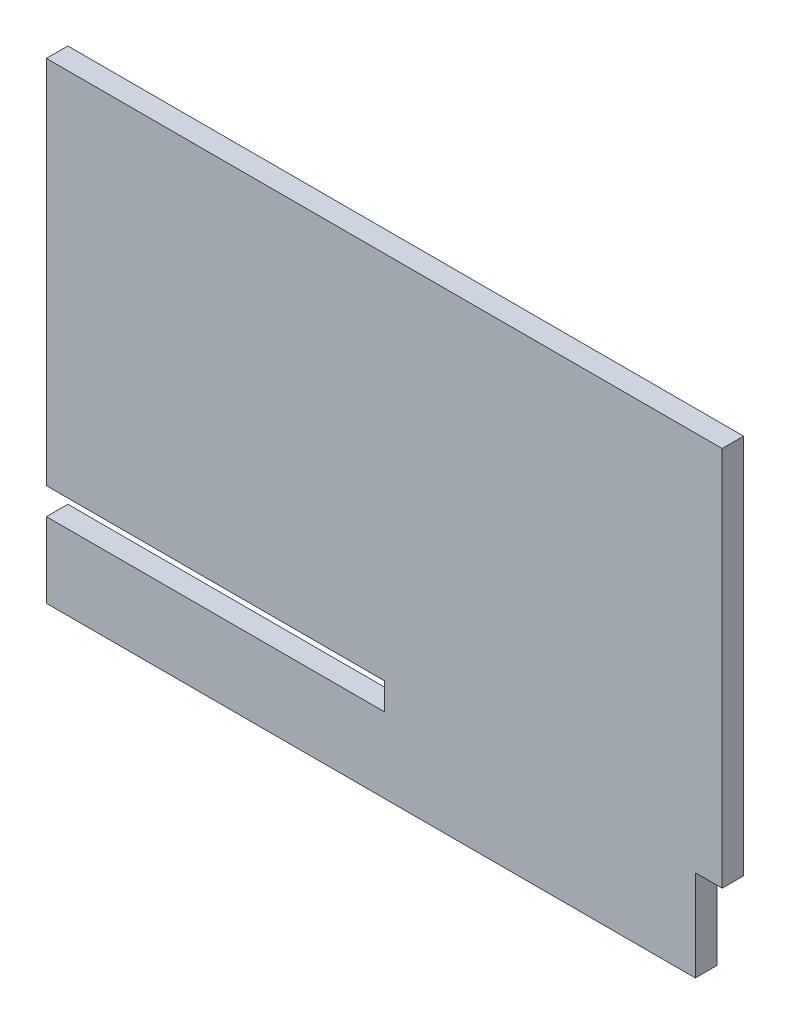
ISO-10303-21;
HEADER;
FILE_DESCRIPTION(('STEP AP214'),'2;1');
FILE_NAME('part.step','',(''),(''),'','','');
FILE_SCHEMA(('AUTOMOTIVE_DESIGN { 1 0 10303 214 1 1 1 1 }'));
ENDSEC;
DATA;
#1=APPLICATION_CONTEXT('core data for automotive mechanical design processes');
#2=APPLICATION_PROTOCOL_DEFINITION('international standard','automotive_design',2000,#1);
#3=PRODUCT_CONTEXT('',#1,'mechanical');
#4=PRODUCT('Part','Part','',(#3));
#5=PRODUCT_RELATED_PRODUCT_CATEGORY('part','',(#4));
#6=PRODUCT_DEFINITION_FORMATION('','',#4);
#7=PRODUCT_DEFINITION_CONTEXT('part definition',#1,'design');
#8=PRODUCT_DEFINITION('design','',#6,#7);
#9=PRODUCT_DEFINITION_SHAPE('','',#8);
#10=(LENGTH_UNIT() NAMED_UNIT(*) SI_UNIT(.MILLI.,.METRE.));
#11=(NAMED_UNIT(*) PLANE_ANGLE_UNIT() SI_UNIT($,.RADIAN.));
#12=(NAMED_UNIT(*) SI_UNIT($,.STERADIAN.) SOLID_ANGLE_UNIT());
#13=UNCERTAINTY_MEASURE_WITH_UNIT(LENGTH_MEASURE(1.E-05),#10,'distance_accuracy_value','');
#14=(GEOMETRIC_REPRESENTATION_CONTEXT(3) GLOBAL_UNCERTAINTY_ASSIGNED_CONTEXT((#13)) GLOBAL_UNIT_ASSIGNED_CONTEXT((#10,
#11,#12)) REPRESENTATION_CONTEXT('',''));
#15=CARTESIAN_POINT('',(0.,0.,0.));
#16=DIRECTION('',(0.,0.,1.));
#17=DIRECTION('',(1.,0.,0.));
#18=AXIS2_PLACEMENT_3D('',#15,#16,#17);
#19=CARTESIAN_POINT('',(-315.,220.,20.));
#20=DIRECTION('',(1.,0.,0.));
#21=DIRECTION('',(0.,0.,-1.));
#22=AXIS2_PLACEMENT_3D('',#19,#20,#21);
#23=PLANE('',#22);
#24=DIRECTION('',(0.,-1.,0.));
#25=VECTOR('',#24,1.);
#26=CARTESIAN_POINT('',(-315.,220.,20.));
#27=LINE('',#26,#25);
#28=CARTESIAN_POINT('',(-315.,-150.,20.));
#29=VERTEX_POINT('',#28);
#30=CARTESIAN_POINT('',(-315.,-220.,20.));
#31=VERTEX_POINT('',#30);
#32=EDGE_CURVE('E97',#29,#31,#27,.T.);
#33=ORIENTED_EDGE('',*,*,#32,.F.);
#34=DIRECTION('',(0.,0.,-1.));
#35=VECTOR('',#34,1.);
#36=CARTESIAN_POINT('',(-315.,-150.,20.));
#37=LINE('',#36,#35);
#38=CARTESIAN_POINT('',(-315.,-150.,0.));
#39=VERTEX_POINT('',#38);
#40=EDGE_CURVE('E187',#29,#39,#37,.T.);
#41=ORIENTED_EDGE('',*,*,#40,.T.);
#42=DIRECTION('',(0.,-1.,0.));
#43=VECTOR('',#42,1.);
#44=CARTESIAN_POINT('',(-315.,220.,0.));
#45=LINE('',#44,#43);
#46=CARTESIAN_POINT('',(-315.,-220.,0.));
#47=VERTEX_POINT('',#46);
#48=EDGE_CURVE('E139',#39,#47,#45,.T.);
#49=ORIENTED_EDGE('',*,*,#48,.T.);
#50=DIRECTION('',(0.,0.,-1.));
#51=VECTOR('',#50,1.);
#52=CARTESIAN_POINT('',(-315.,-220.,20.));
#53=LINE('',#52,#51);
#54=EDGE_CURVE('E153',#31,#47,#53,.T.);
#55=ORIENTED_EDGE('',*,*,#54,.F.);
#56=EDGE_LOOP('',(#33,#41,#49,#55));
#57=FACE_BOUND('',#56,.T.);
#58=ADVANCED_FACE('F38',(#57),#23,.F.);
#59=CARTESIAN_POINT('',(-315.,220.,0.));
#60=VERTEX_POINT('',#59);
#61=CARTESIAN_POINT('',(-315.,-125.,0.));
#62=VERTEX_POINT('',#61);
#63=EDGE_CURVE('E135',#60,#62,#45,.T.);
#64=ORIENTED_EDGE('',*,*,#63,.T.);
#65=DIRECTION('',(0.,0.,1.));
#66=VECTOR('',#65,1.);
#67=CARTESIAN_POINT('',(-315.,-125.,20.));
#68=LINE('',#67,#66);
#69=CARTESIAN_POINT('',(-315.,-125.,20.));
#70=VERTEX_POINT('',#69);
#71=EDGE_CURVE('E53',#62,#70,#68,.T.);
#72=ORIENTED_EDGE('',*,*,#71,.T.);
#73=CARTESIAN_POINT('',(-315.,220.,20.));
#74=VERTEX_POINT('',#73);
#75=EDGE_CURVE('E194',#74,#70,#27,.T.);
#76=ORIENTED_EDGE('',*,*,#75,.F.);
#77=DIRECTION('',(0.,0.,-1.));
#78=VECTOR('',#77,1.);
#79=CARTESIAN_POINT('',(-315.,220.,20.));
#80=LINE('',#79,#78);
#81=EDGE_CURVE('E131',#74,#60,#80,.T.);
#82=ORIENTED_EDGE('',*,*,#81,.T.);
#83=EDGE_LOOP('',(#64,#72,#76,#82));
#84=FACE_BOUND('',#83,.T.);
#85=ADVANCED_FACE('F40',(#84),#23,.F.);
#86=CARTESIAN_POINT('',(-315.,-220.,20.));
#87=DIRECTION('',(0.,1.,0.));
#88=DIRECTION('',(0.,0.,1.));
#89=AXIS2_PLACEMENT_3D('',#86,#87,#88);
#90=PLANE('',#89);
#91=DIRECTION('',(1.,0.,0.));
#92=VECTOR('',#91,1.);
#93=CARTESIAN_POINT('',(-315.,-220.,0.));
#94=LINE('',#93,#92);
#95=CARTESIAN_POINT('',(290.,-220.,0.));
#96=VERTEX_POINT('',#95);
#97=EDGE_CURVE('E138',#47,#96,#94,.T.);
#98=ORIENTED_EDGE('',*,*,#97,.T.);
#99=DIRECTION('',(0.,0.,-1.));
#100=VECTOR('',#99,1.);
#101=CARTESIAN_POINT('',(290.,-220.,20.));
#102=LINE('',#101,#100);
#103=CARTESIAN_POINT('',(290.,-220.,20.));
#104=VERTEX_POINT('',#103);
#105=EDGE_CURVE('E150',#104,#96,#102,.T.);
#106=ORIENTED_EDGE('',*,*,#105,.F.);
#107=DIRECTION('',(1.,0.,0.));
#108=VECTOR('',#107,1.);
#109=CARTESIAN_POINT('',(-315.,-220.,20.));
#110=LINE('',#109,#108);
#111=EDGE_CURVE('E196',#31,#104,#110,.T.);
#112=ORIENTED_EDGE('',*,*,#111,.F.);
#113=ORIENTED_EDGE('',*,*,#54,.T.);
#114=EDGE_LOOP('',(#98,#106,#112,#113));
#115=FACE_BOUND('',#114,.T.);
#116=ADVANCED_FACE('F200',(#115),#90,.F.);
#117=CARTESIAN_POINT('',(290.,-135.,20.));
#118=DIRECTION('',(-1.,0.,0.));
#119=DIRECTION('',(0.,-1.,0.));
#120=AXIS2_PLACEMENT_3D('',#117,#118,#119);
#121=PLANE('',#120);
#122=DIRECTION('',(0.,1.,0.));
#123=VECTOR('',#122,1.);
#124=CARTESIAN_POINT('',(290.,-135.,0.));
#125=LINE('',#124,#123);
#126=CARTESIAN_POINT('',(290.,-135.,0.));
#127=VERTEX_POINT('',#126);
#128=EDGE_CURVE('E141',#96,#127,#125,.T.);
#129=ORIENTED_EDGE('',*,*,#128,.T.);
#130=DIRECTION('',(0.,0.,-1.));
#131=VECTOR('',#130,1.);
#132=CARTESIAN_POINT('',(290.,-135.,20.));
#133=LINE('',#132,#131);
#134=CARTESIAN_POINT('',(290.,-135.,20.));
#135=VERTEX_POINT('',#134);
#136=EDGE_CURVE('E126',#135,#127,#133,.T.);
#137=ORIENTED_EDGE('',*,*,#136,.F.);
#138=DIRECTION('',(0.,1.,0.));
#139=VECTOR('',#138,1.);
#140=CARTESIAN_POINT('',(290.,-135.,20.));
#141=LINE('',#140,#139);
#142=EDGE_CURVE('E114',#104,#135,#141,.T.);
#143=ORIENTED_EDGE('',*,*,#142,.F.);
#144=ORIENTED_EDGE('',*,*,#105,.T.);
#145=EDGE_LOOP('',(#129,#137,#143,#144));
#146=FACE_BOUND('',#145,.T.);
#147=ADVANCED_FACE('F204',(#146),#121,.F.);
#148=CARTESIAN_POINT('',(315.,-135.,20.));
#149=DIRECTION('',(0.,1.,0.));
#150=DIRECTION('',(-1.,0.,0.));
#151=AXIS2_PLACEMENT_3D('',#148,#149,#150);
#152=PLANE('',#151);
#153=DIRECTION('',(1.,0.,0.));
#154=VECTOR('',#153,1.);
#155=CARTESIAN_POINT('',(315.,-135.,0.));
#156=LINE('',#155,#154);
#157=CARTESIAN_POINT('',(315.,-135.,0.));
#158=VERTEX_POINT('',#157);
#159=EDGE_CURVE('E123',#127,#158,#156,.T.);
#160=ORIENTED_EDGE('',*,*,#159,.T.);
#161=DIRECTION('',(0.,0.,-1.));
#162=VECTOR('',#161,1.);
#163=CARTESIAN_POINT('',(315.,-135.,20.));
#164=LINE('',#163,#162);
#165=CARTESIAN_POINT('',(315.,-135.,20.));
#166=VERTEX_POINT('',#165);
#167=EDGE_CURVE('E120',#166,#158,#164,.T.);
#168=ORIENTED_EDGE('',*,*,#167,.F.);
#169=DIRECTION('',(1.,0.,0.));
#170=VECTOR('',#169,1.);
#171=CARTESIAN_POINT('',(315.,-135.,20.));
#172=LINE('',#171,#170);
#173=EDGE_CURVE('E107',#135,#166,#172,.T.);
#174=ORIENTED_EDGE('',*,*,#173,.F.);
#175=ORIENTED_EDGE('',*,*,#136,.T.);
#176=EDGE_LOOP('',(#160,#168,#174,#175));
#177=FACE_BOUND('',#176,.T.);
#178=ADVANCED_FACE('F121',(#177),#152,.F.);
#179=CARTESIAN_POINT('',(315.,220.,20.));
#180=DIRECTION('',(-1.,0.,0.));
#181=DIRECTION('',(0.,-1.,0.));
#182=AXIS2_PLACEMENT_3D('',#179,#180,#181);
#183=PLANE('',#182);
#184=DIRECTION('',(0.,1.,0.));
#185=VECTOR('',#184,1.);
#186=CARTESIAN_POINT('',(315.,220.,0.));
#187=LINE('',#186,#185);
#188=CARTESIAN_POINT('',(315.,220.,0.));
#189=VERTEX_POINT('',#188);
#190=EDGE_CURVE('E144',#158,#189,#187,.T.);
#191=ORIENTED_EDGE('',*,*,#190,.T.);
#192=DIRECTION('',(0.,0.,-1.));
#193=VECTOR('',#192,1.);
#194=CARTESIAN_POINT('',(315.,220.,20.));
#195=LINE('',#194,#193);
#196=CARTESIAN_POINT('',(315.,220.,20.));
#197=VERTEX_POINT('',#196);
#198=EDGE_CURVE('E127',#197,#189,#195,.T.);
#199=ORIENTED_EDGE('',*,*,#198,.F.);
#200=DIRECTION('',(0.,1.,0.));
#201=VECTOR('',#200,1.);
#202=CARTESIAN_POINT('',(315.,220.,20.));
#203=LINE('',#202,#201);
#204=EDGE_CURVE('E111',#166,#197,#203,.T.);
#205=ORIENTED_EDGE('',*,*,#204,.F.);
#206=ORIENTED_EDGE('',*,*,#167,.T.);
#207=EDGE_LOOP('',(#191,#199,#205,#206));
#208=FACE_BOUND('',#207,.T.);
#209=ADVANCED_FACE('F129',(#208),#183,.F.);
#210=CARTESIAN_POINT('',(-315.,220.,20.));
#211=DIRECTION('',(0.,-1.,0.));
#212=DIRECTION('',(0.,0.,-1.));
#213=AXIS2_PLACEMENT_3D('',#210,#211,#212);
#214=PLANE('',#213);
#215=DIRECTION('',(-1.,0.,0.));
#216=VECTOR('',#215,1.);
#217=CARTESIAN_POINT('',(-315.,220.,0.));
#218=LINE('',#217,#216);
#219=EDGE_CURVE('E89',#189,#60,#218,.T.);
#220=ORIENTED_EDGE('',*,*,#219,.T.);
#221=ORIENTED_EDGE('',*,*,#81,.F.);
#222=DIRECTION('',(-1.,0.,0.));
#223=VECTOR('',#222,1.);
#224=CARTESIAN_POINT('',(-315.,220.,20.));
#225=LINE('',#224,#223);
#226=EDGE_CURVE('E62',#197,#74,#225,.T.);
#227=ORIENTED_EDGE('',*,*,#226,.F.);
#228=ORIENTED_EDGE('',*,*,#198,.T.);
#229=EDGE_LOOP('',(#220,#221,#227,#228));
#230=FACE_BOUND('',#229,.T.);
#231=ADVANCED_FACE('F205',(#230),#214,.F.);
#232=CARTESIAN_POINT('',(0.,0.,20.));
#233=DIRECTION('',(0.,0.,1.));
#234=DIRECTION('',(1.,0.,0.));
#235=AXIS2_PLACEMENT_3D('',#232,#233,#234);
#236=PLANE('',#235);
#237=DIRECTION('',(1.,0.,0.));
#238=VECTOR('',#237,1.);
#239=CARTESIAN_POINT('',(-630.,-150.,20.));
#240=LINE('',#239,#238);
#241=CARTESIAN_POINT('',(2.251062219229E-13,-150.,20.));
#242=VERTEX_POINT('',#241);
#243=EDGE_CURVE('E184',#29,#242,#240,.T.);
#244=ORIENTED_EDGE('',*,*,#243,.F.);
#245=ORIENTED_EDGE('',*,*,#32,.T.);
#246=ORIENTED_EDGE('',*,*,#111,.T.);
#247=ORIENTED_EDGE('',*,*,#142,.T.);
#248=ORIENTED_EDGE('',*,*,#173,.T.);
#249=ORIENTED_EDGE('',*,*,#204,.T.);
#250=ORIENTED_EDGE('',*,*,#226,.T.);
#251=ORIENTED_EDGE('',*,*,#75,.T.);
#252=DIRECTION('',(-1.,0.,0.));
#253=VECTOR('',#252,1.);
#254=CARTESIAN_POINT('',(-630.,-125.,20.));
#255=LINE('',#254,#253);
#256=CARTESIAN_POINT('',(2.22044604925031E-13,-125.,20.));
#257=VERTEX_POINT('',#256);
#258=EDGE_CURVE('E210',#257,#70,#255,.T.);
#259=ORIENTED_EDGE('',*,*,#258,.F.);
#260=DIRECTION('',(0.,1.,0.));
#261=VECTOR('',#260,1.);
#262=CARTESIAN_POINT('',(2.22044604925031E-13,-125.,20.));
#263=LINE('',#262,#261);
#264=EDGE_CURVE('E216',#242,#257,#263,.T.);
#265=ORIENTED_EDGE('',*,*,#264,.F.);
#266=EDGE_LOOP('',(#244,#245,#246,#247,#248,#249,#250,#251,#259,#265));
#267=FACE_BOUND('',#266,.T.);
#268=ADVANCED_FACE('F109',(#267),#236,.T.);
#269=CARTESIAN_POINT('',(0.,0.,0.));
#270=DIRECTION('',(0.,0.,1.));
#271=DIRECTION('',(1.,0.,0.));
#272=AXIS2_PLACEMENT_3D('',#269,#270,#271);
#273=PLANE('',#272);
#274=ORIENTED_EDGE('',*,*,#48,.F.);
#275=DIRECTION('',(1.,0.,0.));
#276=VECTOR('',#275,1.);
#277=CARTESIAN_POINT('',(0.,-150.,0.));
#278=LINE('',#277,#276);
#279=CARTESIAN_POINT('',(2.251062219229E-13,-150.,0.));
#280=VERTEX_POINT('',#279);
#281=EDGE_CURVE('E11',#39,#280,#278,.T.);
#282=ORIENTED_EDGE('',*,*,#281,.T.);
#283=DIRECTION('',(0.,1.,0.));
#284=VECTOR('',#283,1.);
#285=CARTESIAN_POINT('',(0.,0.,0.));
#286=LINE('',#285,#284);
#287=CARTESIAN_POINT('',(2.22044604925031E-13,-125.,0.));
#288=VERTEX_POINT('',#287);
#289=EDGE_CURVE('E46',#280,#288,#286,.T.);
#290=ORIENTED_EDGE('',*,*,#289,.T.);
#291=DIRECTION('',(-1.,0.,0.));
#292=VECTOR('',#291,1.);
#293=CARTESIAN_POINT('',(0.,-125.,0.));
#294=LINE('',#293,#292);
#295=EDGE_CURVE('E156',#288,#62,#294,.T.);
#296=ORIENTED_EDGE('',*,*,#295,.T.);
#297=ORIENTED_EDGE('',*,*,#63,.F.);
#298=ORIENTED_EDGE('',*,*,#219,.F.);
#299=ORIENTED_EDGE('',*,*,#190,.F.);
#300=ORIENTED_EDGE('',*,*,#159,.F.);
#301=ORIENTED_EDGE('',*,*,#128,.F.);
#302=ORIENTED_EDGE('',*,*,#97,.F.);
#303=EDGE_LOOP('',(#274,#282,#290,#296,#297,#298,#299,#300,#301,#302));
#304=FACE_BOUND('',#303,.T.);
#305=ADVANCED_FACE('F162',(#304),#273,.F.);
#306=CARTESIAN_POINT('',(2.22044604925031E-13,-125.,-20.));
#307=DIRECTION('',(1.,0.,0.));
#308=DIRECTION('',(0.,1.,0.));
#309=AXIS2_PLACEMENT_3D('',#306,#307,#308);
#310=PLANE('',#309);
#311=DIRECTION('',(0.,0.,1.));
#312=VECTOR('',#311,1.);
#313=CARTESIAN_POINT('',(2.251062219229E-13,-150.,-20.));
#314=LINE('',#313,#312);
#315=EDGE_CURVE('E176',#280,#242,#314,.T.);
#316=ORIENTED_EDGE('',*,*,#315,.T.);
#317=ORIENTED_EDGE('',*,*,#264,.T.);
#318=DIRECTION('',(0.,0.,1.));
#319=VECTOR('',#318,1.);
#320=CARTESIAN_POINT('',(2.22044604925031E-13,-125.,-20.));
#321=LINE('',#320,#319);
#322=EDGE_CURVE('E179',#288,#257,#321,.T.);
#323=ORIENTED_EDGE('',*,*,#322,.F.);
#324=ORIENTED_EDGE('',*,*,#289,.F.);
#325=EDGE_LOOP('',(#316,#317,#323,#324));
#326=FACE_BOUND('',#325,.T.);
#327=ADVANCED_FACE('F173',(#326),#310,.F.);
#328=CARTESIAN_POINT('',(-630.,-150.,-20.));
#329=DIRECTION('',(0.,-1.,0.));
#330=DIRECTION('',(0.,0.,-1.));
#331=AXIS2_PLACEMENT_3D('',#328,#329,#330);
#332=PLANE('',#331);
#333=ORIENTED_EDGE('',*,*,#243,.T.);
#334=ORIENTED_EDGE('',*,*,#315,.F.);
#335=ORIENTED_EDGE('',*,*,#281,.F.);
#336=ORIENTED_EDGE('',*,*,#40,.F.);
#337=EDGE_LOOP('',(#333,#334,#335,#336));
#338=FACE_BOUND('',#337,.T.);
#339=ADVANCED_FACE('F181',(#338),#332,.F.);
#340=CARTESIAN_POINT('',(-630.,-125.,-20.));
#341=DIRECTION('',(0.,1.,0.));
#342=DIRECTION('',(0.,0.,1.));
#343=AXIS2_PLACEMENT_3D('',#340,#341,#342);
#344=PLANE('',#343);
#345=ORIENTED_EDGE('',*,*,#295,.F.);
#346=ORIENTED_EDGE('',*,*,#322,.T.);
#347=ORIENTED_EDGE('',*,*,#258,.T.);
#348=ORIENTED_EDGE('',*,*,#71,.F.);
#349=EDGE_LOOP('',(#345,#346,#347,#348));
#350=FACE_BOUND('',#349,.T.);
#351=ADVANCED_FACE('F241',(#350),#344,.F.);
#352=CLOSED_SHELL('',(#58,#85,#116,#147,#178,#209,#231,#268,#305,#327,#339,#351));
#353=MANIFOLD_SOLID_BREP('B2',#352);
#354=ADVANCED_BREP_SHAPE_REPRESENTATION('',(#18,#353),#14);
#355=SHAPE_DEFINITION_REPRESENTATION(#9,#354);
ENDSEC;
END-ISO-10303-21;
